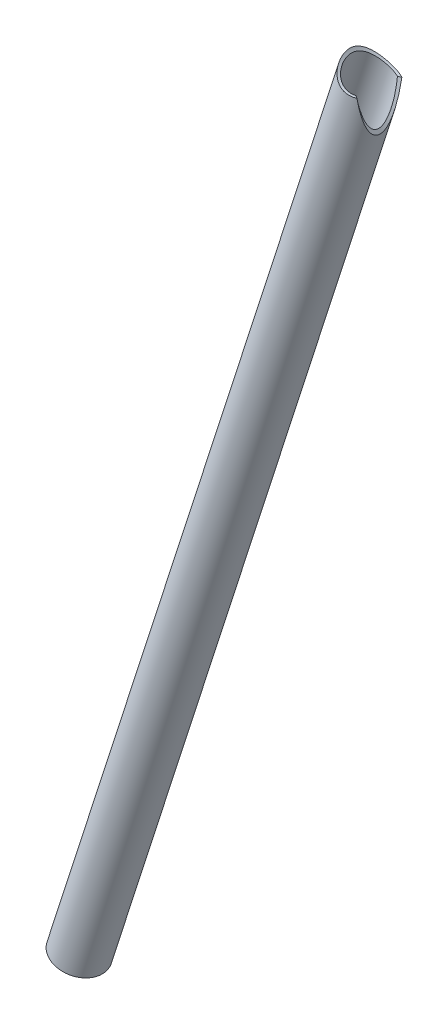
ISO-10303-21;
HEADER;
FILE_DESCRIPTION(('STEP AP214'),'2;1');
FILE_NAME('part.step','',(''),(''),'','','');
FILE_SCHEMA(('AUTOMOTIVE_DESIGN { 1 0 10303 214 1 1 1 1 }'));
ENDSEC;
DATA;
#1=APPLICATION_CONTEXT('core data for automotive mechanical design processes');
#2=APPLICATION_PROTOCOL_DEFINITION('international standard','automotive_design',2000,#1);
#3=PRODUCT_CONTEXT('',#1,'mechanical');
#4=PRODUCT('Part','Part','',(#3));
#5=PRODUCT_RELATED_PRODUCT_CATEGORY('part','',(#4));
#6=PRODUCT_DEFINITION_FORMATION('','',#4);
#7=PRODUCT_DEFINITION_CONTEXT('part definition',#1,'design');
#8=PRODUCT_DEFINITION('design','',#6,#7);
#9=PRODUCT_DEFINITION_SHAPE('','',#8);
#10=(LENGTH_UNIT() NAMED_UNIT(*) SI_UNIT(.MILLI.,.METRE.));
#11=(NAMED_UNIT(*) PLANE_ANGLE_UNIT() SI_UNIT($,.RADIAN.));
#12=(NAMED_UNIT(*) SI_UNIT($,.STERADIAN.) SOLID_ANGLE_UNIT());
#13=UNCERTAINTY_MEASURE_WITH_UNIT(LENGTH_MEASURE(1.E-05),#10,'distance_accuracy_value','');
#14=(GEOMETRIC_REPRESENTATION_CONTEXT(3) GLOBAL_UNCERTAINTY_ASSIGNED_CONTEXT((#13)) GLOBAL_UNIT_ASSIGNED_CONTEXT((#10,
#11,#12)) REPRESENTATION_CONTEXT('',''));
#15=CARTESIAN_POINT('',(0.,0.,0.));
#16=DIRECTION('',(0.,0.,1.));
#17=DIRECTION('',(1.,0.,0.));
#18=AXIS2_PLACEMENT_3D('',#15,#16,#17);
#19=CARTESIAN_POINT('',(-0.475660045373399,524.183761382044,114.597216694036));
#20=DIRECTION('',(-0.0599256750075872,0.0388990717535077,0.997444622869661));
#21=DIRECTION('',(-0.732310027678345,-0.680747809489739,-0.0174483018275184));
#22=AXIS2_PLACEMENT_3D('',#19,#20,#21);
#23=CYLINDRICAL_SURFACE('',#22,11.1125);
#24=CARTESIAN_POINT('',(5.9130729523752,513.91124542213,99.6143753399968));
#25=CARTESIAN_POINT('',(5.75570565116612,513.81945741269,99.5727871745621));
#26=CARTESIAN_POINT('',(5.59461789148314,513.731311486549,99.5371532134711));
#27=CARTESIAN_POINT('',(5.2661139336885,513.563084254013,99.4781106309356));
#28=CARTESIAN_POINT('',(5.09869760368943,513.483003115815,99.4547022644233));
#29=CARTESIAN_POINT('',(4.75931812721733,513.331984601959,99.4204963347299));
#30=CARTESIAN_POINT('',(4.58737523928025,513.261012813432,99.4096499888891));
#31=CARTESIAN_POINT('',(4.23961455037224,513.1284100334,99.4004992234678));
#32=CARTESIAN_POINT('',(4.06379702825878,513.066778372185,99.4021939042293));
#33=CARTESIAN_POINT('',(3.7094936648328,512.953169170453,99.4180501875683));
#34=CARTESIAN_POINT('',(3.53100605324812,512.901198372193,99.4322204575124));
#35=CARTESIAN_POINT('',(3.1728253998558,512.80709829969,99.4727860372781));
#36=CARTESIAN_POINT('',(2.99313226721425,512.76496977581,99.4991822787368));
#37=CARTESIAN_POINT('',(2.6337941113973,512.690473007012,99.5638124781305));
#38=CARTESIAN_POINT('',(2.45414912898686,512.658108289923,99.6020507046886));
#39=CARTESIAN_POINT('',(2.09618473571725,512.602896321692,99.6898543898448));
#40=CARTESIAN_POINT('',(1.91786534060131,512.580049183408,99.7394199827503));
#41=CARTESIAN_POINT('',(1.55942235433526,512.543018351689,99.8506194402023));
#42=CARTESIAN_POINT('',(1.3793565811676,512.52905342561,99.9125120909829));
#43=CARTESIAN_POINT('',(1.02274088782092,512.510068487773,100.046950269955));
#44=CARTESIAN_POINT('',(0.846192150745743,512.505051437396,100.119499316384));
#45=CARTESIAN_POINT('',(0.323277111994263,512.5024243111,100.352162833503));
#46=CARTESIAN_POINT('',(-0.0165647268524844,512.517218574327,100.527358547598));
#47=CARTESIAN_POINT('',(-0.726292416636864,512.578363792574,100.945007321336));
#48=CARTESIAN_POINT('',(-1.09204632214175,512.62946537375,101.193768535987));
#49=CARTESIAN_POINT('',(-1.61156470675109,512.725234864702,101.599749724742));
#50=CARTESIAN_POINT('',(-1.7801125256323,512.760410308454,101.740782497087));
#51=CARTESIAN_POINT('',(-2.10649689790694,512.835658250949,102.033505346257));
#52=CARTESIAN_POINT('',(-2.26433641620159,512.875729385502,102.185192449254));
#53=CARTESIAN_POINT('',(-2.59321150356313,512.96603084146,102.524752787528));
#54=CARTESIAN_POINT('',(-2.76217392444923,513.016850130181,102.714483564573));
#55=CARTESIAN_POINT('',(-3.08237229591199,513.120246603979,103.108065513686));
#56=CARTESIAN_POINT('',(-3.23360261383858,513.172824340851,103.31192114001));
#57=CARTESIAN_POINT('',(-3.51545326221232,513.276461183958,103.732982212855));
#58=CARTESIAN_POINT('',(-3.64613012717742,513.327524130905,103.950148672705));
#59=CARTESIAN_POINT('',(-3.88431320492516,513.424782963256,104.39781878404));
#60=CARTESIAN_POINT('',(-3.99183791010801,513.470982717863,104.628311603235));
#61=CARTESIAN_POINT('',(-4.14582743317662,513.539505235199,105.014755246104));
#62=CARTESIAN_POINT('',(-4.20023732413038,513.56437865596,105.167116460131));
#63=CARTESIAN_POINT('',(-4.29750972504381,513.609811756825,105.476090770791));
#64=CARTESIAN_POINT('',(-4.34037597905646,513.630372835112,105.63270247064));
#65=CARTESIAN_POINT('',(-4.41373345284299,513.666391236589,105.949138610716));
#66=CARTESIAN_POINT('',(-4.44424298392009,513.681856105416,106.108957925977));
#67=CARTESIAN_POINT('',(-4.49240114548017,513.707177074934,106.430976358802));
#68=CARTESIAN_POINT('',(-4.51004949702411,513.717033053976,106.593175527903));
#69=CARTESIAN_POINT('',(-4.53222370089652,513.730898788571,106.919046450562));
#70=CARTESIAN_POINT('',(-4.53672307626078,513.734896740261,107.082720510544));
#71=CARTESIAN_POINT('',(-4.5325889970769,513.737096714385,107.409930346891));
#72=CARTESIAN_POINT('',(-4.52395567725184,513.735298796277,107.573466124659));
#73=CARTESIAN_POINT('',(-4.49393098049643,513.726310378,107.89939044844));
#74=CARTESIAN_POINT('',(-4.47252475570666,513.719113599419,108.061777436401));
#75=CARTESIAN_POINT('',(-4.41757474704508,513.69997970347,108.384270342382));
#76=CARTESIAN_POINT('',(-4.38402384350944,513.688039805107,108.544374864992));
#77=CARTESIAN_POINT('',(-4.29471983206868,513.656397085678,108.905267333265));
#78=CARTESIAN_POINT('',(-4.23539297458775,513.635460686061,109.105065439734));
#79=CARTESIAN_POINT('',(-4.09997057811465,513.589076083644,109.498371984321));
#80=CARTESIAN_POINT('',(-4.02386827660903,513.563626062125,109.69187784971));
#81=CARTESIAN_POINT('',(-3.85645838220008,513.510059692569,110.072035633533));
#82=CARTESIAN_POINT('',(-3.76513411445261,513.481940435233,110.258679758583));
#83=CARTESIAN_POINT('',(-3.56878076596856,513.424810951531,110.624424066729));
#84=CARTESIAN_POINT('',(-3.4637524853821,513.395800777259,110.803524689469));
#85=CARTESIAN_POINT('',(-3.23830233822173,513.337737686697,111.158411078941));
#86=CARTESIAN_POINT('',(-3.11755238265823,513.308703101584,111.333991039212));
#87=CARTESIAN_POINT('',(-2.86391089337281,513.252917481815,111.676616090019));
#88=CARTESIAN_POINT('',(-2.73101511979191,513.226167250932,111.843658168181));
#89=CARTESIAN_POINT('',(-2.45395527123531,513.176373226213,112.168824207186));
#90=CARTESIAN_POINT('',(-2.3097867697621,513.15333089934,112.326944622347));
#91=CARTESIAN_POINT('',(-2.01101844368042,513.11228279978,112.633701876649));
#92=CARTESIAN_POINT('',(-1.85641834919074,513.094277157463,112.782338470236));
#93=CARTESIAN_POINT('',(-1.50335276509599,513.061355302113,113.100280581171));
#94=CARTESIAN_POINT('',(-1.30258248248774,513.047925943267,113.267197790915));
#95=CARTESIAN_POINT('',(-0.88806509775176,513.032398922576,113.584783665214));
#96=CARTESIAN_POINT('',(-0.674315293816763,513.030303628255,113.735448928529));
#97=CARTESIAN_POINT('',(-0.235783523246276,513.039363177531,114.018579235055));
#98=CARTESIAN_POINT('',(-0.0110196313970217,513.050496966321,114.15107282553));
#99=CARTESIAN_POINT('',(0.447885549556993,513.087682424298,114.396173830336));
#100=CARTESIAN_POINT('',(0.682022496806226,513.113727258978,114.508790324454));
#101=CARTESIAN_POINT('',(1.09224583190681,513.172717489412,114.684312525011));
#102=CARTESIAN_POINT('',(1.26669053083149,513.201825996613,114.752389392396));
#103=CARTESIAN_POINT('',(1.61819096089341,513.268978610741,114.876250893515));
#104=CARTESIAN_POINT('',(1.79524610273848,513.307020729051,114.93203825754));
#105=CARTESIAN_POINT('',(2.15065368537754,513.392214849251,115.03061358145));
#106=CARTESIAN_POINT('',(2.32900519310494,513.439360823698,115.073410094312));
#107=CARTESIAN_POINT('',(2.68572263730351,513.542758955722,115.145479515804));
#108=CARTESIAN_POINT('',(2.86408852852994,513.599006870186,115.174758701512));
#109=CARTESIAN_POINT('',(3.20822402177937,513.716548889002,115.21801509928));
#110=CARTESIAN_POINT('',(3.37407391639886,513.777295323432,115.232846335335));
#111=CARTESIAN_POINT('',(3.70350633186681,513.906250659939,115.25018670187));
#112=CARTESIAN_POINT('',(3.86708884607149,513.974459583876,115.252695796251));
#113=CARTESIAN_POINT('',(4.1914491783138,514.118093894455,115.24538712746));
#114=CARTESIAN_POINT('',(4.35221522022983,514.193543627699,115.235526327756));
#115=CARTESIAN_POINT('',(4.66937686170016,514.350797987806,115.203622794231));
#116=CARTESIAN_POINT('',(4.82577239310461,514.432602713689,115.181579870564));
#117=CARTESIAN_POINT('',(4.97949145869509,514.517253673282,115.153555178421));
#118=B_SPLINE_CURVE_WITH_KNOTS('',3,(#24,#25,#26,#27,#28,#29,#30,#31,#32,#33,#34,#35,#36,#37,
#38,#39,#40,#41,#42,#43,#44,#45,#46,#47,#48,#49,#50,#51,#52,#53,#54,#55,#56,#57,#58,#59,#60,#61,
#62,#63,#64,#65,#66,#67,#68,#69,#70,#71,#72,#73,#74,#75,#76,#77,#78,#79,#80,#81,#82,#83,#84,#85,
#86,#87,#88,#89,#90,#91,#92,#93,#94,#95,#96,#97,#98,#99,#100,#101,#102,#103,#104,#105,#106,#107,
#108,#109,#110,#111,#112,#113,#114,#115,#116,#117),.UNSPECIFIED.,.F.,.F.,(4,2,2,2,2,2,2,2,2,2,2,
2,2,2,2,2,2,2,2,2,2,2,2,2,2,2,2,2,2,2,2,2,2,2,2,2,2,2,2,2,2,2,2,2,2,2,4),(0.,0.560463353954686,
1.12093839441187,1.67922954084714,2.23748063743734,2.79611988311252,3.35480170492397,
3.91368514693435,4.47257521591132,5.04474599409809,5.6171061023101,6.76118008767089,
8.09173617145039,8.75898633544301,9.42605099160713,10.2023766392781,10.9789482245999,
11.7533449301444,12.5271207857498,13.0177268561292,13.5081736115972,13.9978908960696,
14.4876188014343,14.9783321526583,15.4690404698842,15.9603203251662,16.45188865471,
17.079359751845,17.7070842590866,18.3355009792519,18.9638810238171,19.6085265882527,
20.2533980512338,20.8985240220205,21.5436666896027,22.3269373986349,23.1103717153677,
23.8925608219497,24.6743916973304,25.2423410760549,25.8101641491172,26.3776125612884,
26.9447972002078,27.4759455536384,28.007095463087,28.5400984505142,29.0731097444833),.UNSPECIFIED.);
#119=CARTESIAN_POINT('',(0.845729685967483,512.506421026561,100.121684494328));
#120=VERTEX_POINT('',#119);
#121=CARTESIAN_POINT('',(-0.149670311386206,512.530385853584,100.608563602288));
#122=VERTEX_POINT('',#121);
#123=EDGE_CURVE('E70',#120,#122,#118,.T.);
#124=ORIENTED_EDGE('',*,*,#123,.F.);
#125=CARTESIAN_POINT('',(5.29417473859454,514.09064985966,106.832821409542));
#126=CARTESIAN_POINT('',(5.29887131290029,514.105921051289,107.011335789787));
#127=CARTESIAN_POINT('',(5.2960084272661,514.117199943479,107.190451095485));
#128=CARTESIAN_POINT('',(5.27500203406285,514.131416171019,107.548199036743));
#129=CARTESIAN_POINT('',(5.25684911818113,514.134348365585,107.726831307171));
#130=CARTESIAN_POINT('',(5.2055261655022,514.132052735206,108.082246870067));
#131=CARTESIAN_POINT('',(5.17232475039703,514.12680780373,108.259025505407));
#132=CARTESIAN_POINT('',(5.09163137495636,514.108808332124,108.608852001149));
#133=CARTESIAN_POINT('',(5.04414069851382,514.096054466573,108.781900195237));
#134=CARTESIAN_POINT('',(4.93640636392974,514.064238616779,109.121406731347));
#135=CARTESIAN_POINT('',(4.87629738848587,514.045242140149,109.287914210304));
#136=CARTESIAN_POINT('',(4.74408835638654,514.002096941516,109.615439623003));
#137=CARTESIAN_POINT('',(4.67198248789722,513.977945720712,109.776454850271));
#138=CARTESIAN_POINT('',(4.43918147454897,513.899634063985,110.25053296402));
#139=CARTESIAN_POINT('',(4.26198728189582,513.839610490097,110.554676082869));
#140=CARTESIAN_POINT('',(3.92658080229634,513.731434817345,111.053865458538));
#141=CARTESIAN_POINT('',(3.77724259060224,513.684745179177,111.255385158984));
#142=CARTESIAN_POINT('',(3.46160096430522,513.591230657946,111.644810376277));
#143=CARTESIAN_POINT('',(3.29529162311677,513.544405733223,111.832711097716));
#144=CARTESIAN_POINT('',(2.94709305321059,513.453265738846,112.194641922495));
#145=CARTESIAN_POINT('',(2.76518129691463,513.408954457148,112.368651244786));
#146=CARTESIAN_POINT('',(2.3872916911531,513.325331420242,112.701944494131));
#147=CARTESIAN_POINT('',(2.19131553047147,513.286019066353,112.861230183889));
#148=CARTESIAN_POINT('',(1.78461776421792,513.214283180333,113.165672061542));
#149=CARTESIAN_POINT('',(1.57377833077769,513.181925505638,113.310686673762));
#150=CARTESIAN_POINT('',(1.14018342509742,513.126688737969,113.583832128033));
#151=CARTESIAN_POINT('',(0.917426726794884,513.103810622389,113.711961228169));
#152=CARTESIAN_POINT('',(0.461940878889936,513.069581378099,113.949688050759));
#153=CARTESIAN_POINT('',(0.229233373683126,513.058206437313,114.05932366168));
#154=CARTESIAN_POINT('',(-0.24476831500328,513.048747988078,114.258774610303));
#155=CARTESIAN_POINT('',(-0.48605920835233,513.050659440242,114.34859744944));
#156=CARTESIAN_POINT('',(-0.912356829309223,513.066954563285,114.486508492756));
#157=CARTESIAN_POINT('',(-1.09595270879993,513.078018806789,114.539393731244));
#158=CARTESIAN_POINT('',(-1.46556498877955,513.108895481694,114.632621548335));
#159=CARTESIAN_POINT('',(-1.6515808599116,513.128706030118,114.67296682346));
#160=CARTESIAN_POINT('',(-2.02471387362773,513.177445340467,114.740506561878));
#161=CARTESIAN_POINT('',(-2.21183041012501,513.206369474883,114.767707681519));
#162=CARTESIAN_POINT('',(-2.58589105968332,513.273537949801,114.808514380689));
#163=CARTESIAN_POINT('',(-2.77283516774436,513.311782552542,114.822119577632));
#164=CARTESIAN_POINT('',(-3.14567401999034,513.397715527463,114.83544598625));
#165=CARTESIAN_POINT('',(-3.33156354799764,513.44543349781,114.835122979537));
#166=CARTESIAN_POINT('',(-3.70019224549397,513.549995542304,114.820381713559));
#167=CARTESIAN_POINT('',(-3.88293142190937,513.606839596383,114.805963485287));
#168=CARTESIAN_POINT('',(-4.24382934449132,513.729195004887,114.763154700622));
#169=CARTESIAN_POINT('',(-4.42198765344713,513.794707182981,114.734762815715));
#170=CARTESIAN_POINT('',(-4.77238139714384,513.933730313336,114.664349406136));
#171=CARTESIAN_POINT('',(-4.94461693838751,514.007241121666,114.622328126689));
#172=CARTESIAN_POINT('',(-5.27401020834472,514.157772859776,114.527496957816));
#173=CARTESIAN_POINT('',(-5.43149556763064,514.234461535643,114.475293865083));
#174=CARTESIAN_POINT('',(-5.73931132330597,514.393564957316,114.359566398535));
#175=CARTESIAN_POINT('',(-5.88963921846976,514.475981680436,114.296038103312));
#176=CARTESIAN_POINT('',(-6.18242998280031,514.645634287735,114.158338671381));
#177=CARTESIAN_POINT('',(-6.32489490343046,514.732868902921,114.084170329029));
#178=CARTESIAN_POINT('',(-6.60159487677913,514.911294802801,113.92585652502));
#179=CARTESIAN_POINT('',(-6.73582689425555,515.00248752583,113.841707416878));
#180=CARTESIAN_POINT('',(-7.14930546757193,515.297512610164,113.559165335699));
#181=CARTESIAN_POINT('',(-7.41263452584189,515.507205365528,113.343197662276));
#182=CARTESIAN_POINT('',(-7.8977076952688,515.932093525035,112.873362088983));
#183=CARTESIAN_POINT('',(-8.11941905367229,516.147293112926,112.619464618548));
#184=CARTESIAN_POINT('',(-8.43961729924997,516.486696530918,112.18949241682));
#185=CARTESIAN_POINT('',(-8.55141111298729,516.612113288493,112.024068860757));
#186=CARTESIAN_POINT('',(-8.76111661987963,516.85983600782,111.682348261175));
#187=CARTESIAN_POINT('',(-8.85902595980808,516.982141439369,111.506049381688));
#188=CARTESIAN_POINT('',(-9.04125624511243,517.221601020644,111.143072488937));
#189=CARTESIAN_POINT('',(-9.12556959691503,517.3387522653,110.956388753311));
#190=CARTESIAN_POINT('',(-9.28077982830921,517.56551493786,110.57314009754));
#191=CARTESIAN_POINT('',(-9.35167910056684,517.675127708175,110.376576947517));
#192=CARTESIAN_POINT('',(-9.47013599994479,517.867765132284,110.00550266978));
#193=CARTESIAN_POINT('',(-9.51961047119747,517.952263691152,109.83236727453));
#194=CARTESIAN_POINT('',(-9.60916024475464,518.11219473564,109.479565758128));
#195=CARTESIAN_POINT('',(-9.64923564341324,518.187627314196,109.299899703947));
#196=CARTESIAN_POINT('',(-9.71988054373792,518.327263998026,108.93476708474));
#197=CARTESIAN_POINT('',(-9.75046598452656,518.391486850646,108.749310827936));
#198=CARTESIAN_POINT('',(-9.80210997896525,518.506650933044,108.373039207796));
#199=CARTESIAN_POINT('',(-9.82317194918639,518.557596923149,108.182225792489));
#200=CARTESIAN_POINT('',(-9.85263936755054,518.636044954417,107.832046897656));
#201=CARTESIAN_POINT('',(-9.86266586678876,518.666140915389,107.673397687762));
#202=CARTESIAN_POINT('',(-9.87624339258512,518.715024369319,107.354158395346));
#203=CARTESIAN_POINT('',(-9.87979805497872,518.733818207758,107.193569453633));
#204=CARTESIAN_POINT('',(-9.88040518230365,518.759314272853,106.871526586472));
#205=CARTESIAN_POINT('',(-9.87746231045743,518.766025165056,106.710073364277));
#206=CARTESIAN_POINT('',(-9.86509728740428,518.766961377914,106.387370849301));
#207=CARTESIAN_POINT('',(-9.85567503703367,518.761186507477,106.226121559677));
#208=CARTESIAN_POINT('',(-9.83042299777208,518.73717988116,105.905066740607));
#209=CARTESIAN_POINT('',(-9.81459336329012,518.718948425458,105.745261176462));
#210=CARTESIAN_POINT('',(-9.77665035908226,518.670507674773,105.42824673982));
#211=CARTESIAN_POINT('',(-9.75453701103305,518.640298421109,105.271037858367));
#212=CARTESIAN_POINT('',(-9.70415302905823,518.568709675905,104.960020697085));
#213=CARTESIAN_POINT('',(-9.67587564243958,518.527317921958,104.806216352089));
#214=CARTESIAN_POINT('',(-9.61332379841815,518.434453922741,104.502861686994));
#215=CARTESIAN_POINT('',(-9.57904588343316,518.38297586356,104.353313877642));
#216=CARTESIAN_POINT('',(-9.49198219193278,518.252133580618,104.009009375319));
#217=CARTESIAN_POINT('',(-9.43686695454433,518.169239940357,103.816177443208));
#218=CARTESIAN_POINT('',(-9.31637406168443,517.990458820689,103.439956289281));
#219=CARTESIAN_POINT('',(-9.25099206393359,517.89456584563,103.256571106707));
#220=CARTESIAN_POINT('',(-9.1100125416277,517.692397182024,102.89942418096));
#221=CARTESIAN_POINT('',(-9.03440253936,517.58610885618,102.725674563615));
#222=CARTESIAN_POINT('',(-8.87304020945962,517.365662692273,102.388222327174));
#223=CARTESIAN_POINT('',(-8.78728865468528,517.251505454153,102.224518943926));
#224=CARTESIAN_POINT('',(-8.60312143595886,517.014283480522,101.903030526074));
#225=CARTESIAN_POINT('',(-8.50442906030965,516.891062396847,101.745519690999));
#226=CARTESIAN_POINT('',(-8.29604826978162,516.640472127148,101.441339137857));
#227=CARTESIAN_POINT('',(-8.18635587941556,516.51310145274,101.29467337279));
#228=CARTESIAN_POINT('',(-7.95577703833052,516.256019242679,101.012527514295));
#229=CARTESIAN_POINT('',(-7.83488790647037,516.126307152374,100.87705011477));
#230=CARTESIAN_POINT('',(-7.58176122441265,515.866261249123,100.617800296247));
#231=CARTESIAN_POINT('',(-7.44952378122089,515.735927442051,100.494027766903));
#232=CARTESIAN_POINT('',(-7.15000041590969,515.45408891831,100.23873164473));
#233=CARTESIAN_POINT('',(-6.98058406560342,515.302766087752,100.109488575313));
#234=CARTESIAN_POINT('',(-6.62597562760783,515.004081973337,99.8691743528612));
#235=CARTESIAN_POINT('',(-6.44078060796419,514.856721432465,99.7581065883648));
#236=CARTESIAN_POINT('',(-6.05531510652386,514.568902253836,99.5558649502606));
#237=CARTESIAN_POINT('',(-5.8550696934329,514.428432756,99.46465894015));
#238=CARTESIAN_POINT('',(-5.4401583580499,514.156922405693,99.3036014500056));
#239=CARTESIAN_POINT('',(-5.2254993611245,514.025877086941,99.2337398028342));
#240=CARTESIAN_POINT('',(-4.8460933578888,513.81141077216,99.1335251329118));
#241=CARTESIAN_POINT('',(-4.68447054071166,513.725028722666,99.0975863901821));
#242=CARTESIAN_POINT('',(-4.35541011894974,513.559432263806,99.0379706930212));
#243=CARTESIAN_POINT('',(-4.18797378305293,513.480216304017,99.0142910809967));
#244=CARTESIAN_POINT('',(-3.84835407426972,513.329864678773,98.9796030099161));
#245=CARTESIAN_POINT('',(-3.6761737984483,513.25872388985,98.9685864755351));
#246=CARTESIAN_POINT('',(-3.32809804030309,513.125205047679,98.9594452326085));
#247=CARTESIAN_POINT('',(-3.15220241586094,513.062827330335,98.9613210181096));
#248=CARTESIAN_POINT('',(-2.79771832373903,512.947332539766,98.9780462045391));
#249=CARTESIAN_POINT('',(-2.61912630641131,512.894229089878,98.9929145015167));
#250=CARTESIAN_POINT('',(-2.26085229129381,512.797772607284,99.0355226742466));
#251=CARTESIAN_POINT('',(-2.08117029881944,512.754419527068,99.0632624872787));
#252=CARTESIAN_POINT('',(-1.72202356844962,512.677612141887,99.13130829879));
#253=CARTESIAN_POINT('',(-1.54255890482574,512.644160591764,99.1716177880603));
#254=CARTESIAN_POINT('',(-1.18520311439581,512.587113549247,99.2643228016002));
#255=CARTESIAN_POINT('',(-1.00731200023811,512.563518136008,99.316718422928));
#256=CARTESIAN_POINT('',(-0.656513722821927,512.526163780377,99.4322733267595));
#257=CARTESIAN_POINT('',(-0.483572037066276,512.51228524472,99.49528945331));
#258=CARTESIAN_POINT('',(-0.141389802550177,512.493470221988,99.6318846513221));
#259=CARTESIAN_POINT('',(0.0278494193795713,512.488536890328,99.7054674402922));
#260=CARTESIAN_POINT('',(0.528520123536239,512.486395455214,99.9410204594246));
#261=CARTESIAN_POINT('',(0.853162559938359,512.501820148115,100.117881300442));
#262=CARTESIAN_POINT('',(1.5167569930341,512.564743374381,100.529805851926));
#263=CARTESIAN_POINT('',(1.85252355623152,512.615968253369,100.76936034142));
#264=CARTESIAN_POINT('',(2.48846160250641,512.745652594114,101.28607310855));
#265=CARTESIAN_POINT('',(2.78859104925321,512.824143798379,101.56327498388));
#266=CARTESIAN_POINT('',(3.23393225244605,512.96316578246,102.031049821222));
#267=CARTESIAN_POINT('',(3.39243755365198,513.017982996921,102.210897553181));
#268=CARTESIAN_POINT('',(3.69419677278531,513.131702313713,102.581890297626));
#269=CARTESIAN_POINT('',(3.83744715229738,513.190605358554,102.773037915227));
#270=CARTESIAN_POINT('',(4.10737628796845,513.310147449138,103.16622352911));
#271=CARTESIAN_POINT('',(4.2340529849295,513.370786709458,103.368262874239));
#272=CARTESIAN_POINT('',(4.46921266126621,513.491164662842,103.782892036069));
#273=CARTESIAN_POINT('',(4.57770268950415,513.55090369661,103.99547772358));
#274=CARTESIAN_POINT('',(4.74983886572524,513.652024165861,104.37618563049));
#275=CARTESIAN_POINT('',(4.81790805335698,513.694252411157,104.54208937384));
#276=CARTESIAN_POINT('',(4.94176265005566,513.77518749421,104.879308213841));
#277=CARTESIAN_POINT('',(4.99754737885171,513.813894136883,105.050623609569));
#278=CARTESIAN_POINT('',(5.09556947274385,513.886220218301,105.397450920162));
#279=CARTESIAN_POINT('',(5.13785580803315,513.919857806745,105.57294512524));
#280=CARTESIAN_POINT('',(5.20807473249483,513.980809267508,105.927794465511));
#281=CARTESIAN_POINT('',(5.23601741211236,514.008127577846,106.107146793802));
#282=CARTESIAN_POINT('',(5.26650204858832,514.043462157306,106.378074714823));
#283=CARTESIAN_POINT('',(5.27475792487079,514.054297440297,106.468672855446));
#284=CARTESIAN_POINT('',(5.28739443443329,514.073987141824,106.650401913972));
#285=CARTESIAN_POINT('',(5.29177301396974,514.082840508717,106.741533088523));
#286=CARTESIAN_POINT('',(5.29417473859454,514.09064985966,106.832821409542));
#287=B_SPLINE_CURVE_WITH_KNOTS('',3,(#125,#126,#127,#128,#129,#130,#131,#132,#133,#134,#135,
#136,#137,#138,#139,#140,#141,#142,#143,#144,#145,#146,#147,#148,#149,#150,#151,#152,#153,#154,
#155,#156,#157,#158,#159,#160,#161,#162,#163,#164,#165,#166,#167,#168,#169,#170,#171,#172,#173,
#174,#175,#176,#177,#178,#179,#180,#181,#182,#183,#184,#185,#186,#187,#188,#189,#190,#191,#192,
#193,#194,#195,#196,#197,#198,#199,#200,#201,#202,#203,#204,#205,#206,#207,#208,#209,#210,#211,
#212,#213,#214,#215,#216,#217,#218,#219,#220,#221,#222,#223,#224,#225,#226,#227,#228,#229,#230,
#231,#232,#233,#234,#235,#236,#237,#238,#239,#240,#241,#242,#243,#244,#245,#246,#247,#248,#249,
#250,#251,#252,#253,#254,#255,#256,#257,#258,#259,#260,#261,#262,#263,#264,#265,#266,#267,#268,
#269,#270,#271,#272,#273,#274,#275,#276,#277,#278,#279,#280,#281,#282,#283,#284,#285,#286),
.UNSPECIFIED.,.T.,.F.,(4,2,2,2,2,2,2,2,2,2,2,2,2,2,2,2,2,2,2,2,2,2,2,2,2,2,2,2,2,2,2,2,2,2,2,2,
2,2,2,2,2,2,2,2,2,2,2,2,2,2,2,2,2,2,2,2,2,2,2,2,2,2,2,2,2,2,2,2,2,2,2,2,2,2,2,2,2,2,2,2,4),(0.,
0.537573187970764,1.07547739912958,1.61450841568219,2.15349101464677,2.68698929400761,
3.22074678047323,4.28811161681994,5.05269587078132,5.8175480493138,6.58352377605878,
7.34940768162977,8.1222524385707,8.895176860186,9.66649799899464,10.4375265999706,
11.0110990553793,11.5845480875812,12.157706413587,12.7308808676992,13.3058751337591,
13.8808681354744,14.4559158139332,15.0309531465155,15.5786946013315,16.1266260840399,
16.6744139280755,17.2224025271075,18.4174321262966,19.6133982957202,20.320136467705,
21.0269942792552,21.7342455247785,22.4413704988943,23.0376050471546,23.6338334828804,
24.229055016895,24.8240628438032,25.3089403183394,25.7935453077403,26.2778026135183,
26.7620673307795,27.246320378632,27.730571755996,28.2153563200581,28.7004211483076,
29.350477162006,30.0008088581575,30.6519412081266,31.3030239691203,31.9714674083209,
32.6401533046179,33.3089997386435,33.9778398666553,34.7607944898401,35.543894918398,
36.3257187105696,37.1071695074008,37.6668439956602,38.2263971041284,38.7855931837126,
39.3448106923689,39.9048428719865,40.4648723227185,41.0250574409016,41.5852470578267,
42.1384146638492,42.691777361409,43.7976920179299,45.0402062134829,46.284171775466,
47.0212623806408,47.7585235850366,48.4958763036731,49.2329425720825,49.7851746974353,
50.3374373958088,50.8876731754326,51.4375213440299,51.7122789805901,51.9871820650792),.UNSPECIFIED.);
#288=CARTESIAN_POINT('',(0.00263960369829752,513.053689315165,114.154662329749));
#289=VERTEX_POINT('',#288);
#290=EDGE_CURVE('E82',#289,#120,#287,.T.);
#291=ORIENTED_EDGE('',*,*,#290,.F.);
#292=CARTESIAN_POINT('',(-0.92729552789105,513.035159460061,113.551898670475));
#293=VERTEX_POINT('',#292);
#294=EDGE_CURVE('E53',#293,#289,#118,.T.);
#295=ORIENTED_EDGE('',*,*,#294,.F.);
#296=CARTESIAN_POINT('',(4.20677357722796,513.579522905785,106.848668984383));
#297=CARTESIAN_POINT('',(4.21051371124519,513.591679203165,107.016371139129));
#298=CARTESIAN_POINT('',(4.20708406281389,513.600968810017,107.184447618743));
#299=CARTESIAN_POINT('',(4.18580608970749,513.613596211461,107.519973788917));
#300=CARTESIAN_POINT('',(4.16795220248857,513.616931708325,107.687423212629));
#301=CARTESIAN_POINT('',(4.11806229024851,513.617780238996,108.020403786548));
#302=CARTESIAN_POINT('',(4.08600951855789,513.615286382557,108.185932434047));
#303=CARTESIAN_POINT('',(4.00828113895968,513.604927123863,108.513649541598));
#304=CARTESIAN_POINT('',(3.96259924883412,513.597059242339,108.675836424359));
#305=CARTESIAN_POINT('',(3.85880069402672,513.576752256795,108.994521692134));
#306=CARTESIAN_POINT('',(3.8007797340955,513.564347834599,109.15105358667));
#307=CARTESIAN_POINT('',(3.67297578961154,513.535832973094,109.458917879717));
#308=CARTESIAN_POINT('',(3.60318809263375,513.519721048033,109.610248165703));
#309=CARTESIAN_POINT('',(3.3775629422216,513.467259334358,110.055393784644));
#310=CARTESIAN_POINT('',(3.20539874386667,513.426769122965,110.340557534084));
#311=CARTESIAN_POINT('',(2.803749563348,513.337973044409,110.913544164866));
#312=CARTESIAN_POINT('',(2.57009586027402,513.289294749115,111.198368114266));
#313=CARTESIAN_POINT('',(2.19112617934981,513.220412226609,111.599118749584));
#314=CARTESIAN_POINT('',(2.05995174379789,513.198126223675,111.728370215814));
#315=CARTESIAN_POINT('',(1.78873134659657,513.155990411976,111.977737008619));
#316=CARTESIAN_POINT('',(1.6486836570695,513.136141079926,112.097850545693));
#317=CARTESIAN_POINT('',(1.33352743856261,513.096535623683,112.350019519856));
#318=CARTESIAN_POINT('',(1.15675611504495,513.07748941303,112.480114981689));
#319=CARTESIAN_POINT('',(0.792984615178949,513.045915044751,112.72589620435));
#320=CARTESIAN_POINT('',(0.605987827048157,513.033384742363,112.841586697138));
#321=CARTESIAN_POINT('',(0.22305323995097,513.016340743644,113.057565327424));
#322=CARTESIAN_POINT('',(0.0271199836481819,513.011823019865,113.157861179725));
#323=CARTESIAN_POINT('',(-0.372315855375324,513.012170707288,113.341981422515));
#324=CARTESIAN_POINT('',(-0.575816362737576,513.017033564162,113.425810290112));
#325=CARTESIAN_POINT('',(-0.94837799016394,513.035348511538,113.561178625516));
#326=CARTESIAN_POINT('',(-1.11640688620702,513.046938506564,113.615826841623));
#327=CARTESIAN_POINT('',(-1.4552434862566,513.077472020918,113.71309327753));
#328=CARTESIAN_POINT('',(-1.62605064729299,513.096414119545,113.755713818777));
#329=CARTESIAN_POINT('',(-1.96920331785149,513.142018056488,113.828354517295));
#330=CARTESIAN_POINT('',(-2.14154780076221,513.168675069543,113.858382521853));
#331=CARTESIAN_POINT('',(-2.48661632060124,513.229930616572,113.905419925556));
#332=CARTESIAN_POINT('',(-2.6593403644356,513.264529296248,113.922429085825));
#333=CARTESIAN_POINT('',(-3.00438666155996,513.341825997655,113.943146120567));
#334=CARTESIAN_POINT('',(-3.17670564766192,513.384550676959,113.94680939308));
#335=CARTESIAN_POINT('',(-3.51896050921355,513.477847790355,113.94057243926));
#336=CARTESIAN_POINT('',(-3.68889638406025,513.528420226432,113.930672209495));
#337=CARTESIAN_POINT('',(-4.02502705890745,513.637034286329,113.897370482163));
#338=CARTESIAN_POINT('',(-4.19122161137951,513.695076402653,113.873968093996));
#339=CARTESIAN_POINT('',(-4.5185833585688,513.818056401146,113.813924624456));
#340=CARTESIAN_POINT('',(-4.67975067968479,513.88299410976,113.777283876226));
#341=CARTESIAN_POINT('',(-4.98763532428761,514.015463580779,113.693467766208));
#342=CARTESIAN_POINT('',(-5.13466714076763,514.082680497116,113.646945964025));
#343=CARTESIAN_POINT('',(-5.42246440027812,514.221956200115,113.542889724051));
#344=CARTESIAN_POINT('',(-5.56322767375596,514.294016641807,113.485351509418));
#345=CARTESIAN_POINT('',(-5.83775313796042,514.442152818269,113.35985952096));
#346=CARTESIAN_POINT('',(-5.97151736790676,514.51822737038,113.291908803812));
#347=CARTESIAN_POINT('',(-6.23165771231058,514.673616379346,113.146162859686));
#348=CARTESIAN_POINT('',(-6.35803097176328,514.752932068361,113.068363864731));
#349=CARTESIAN_POINT('',(-6.61205705189892,514.919892941936,112.897457632138));
#350=CARTESIAN_POINT('',(-6.73911556807225,515.007720767264,112.803644274355));
#351=CARTESIAN_POINT('',(-6.9840268766979,515.185074858644,112.606121374112));
#352=CARTESIAN_POINT('',(-7.10187648495687,515.274601698987,112.502408435938));
#353=CARTESIAN_POINT('',(-7.44149590987072,515.544271089133,112.177308001554));
#354=CARTESIAN_POINT('',(-7.64936175386139,515.725519572066,111.941941568538));
#355=CARTESIAN_POINT('',(-7.94704714799105,516.006244469044,111.545936006231));
#356=CARTESIAN_POINT('',(-8.04953758881921,516.107793973799,111.395950278425));
#357=CARTESIAN_POINT('',(-8.24217993407929,516.307247895007,111.085951513899));
#358=CARTESIAN_POINT('',(-8.33233436484268,516.405153054797,110.925940540097));
#359=CARTESIAN_POINT('',(-8.50038420315971,516.595538372489,110.596431503918));
#360=CARTESIAN_POINT('',(-8.57827558585956,516.688016743043,110.426930351413));
#361=CARTESIAN_POINT('',(-8.72177441669417,516.8655175798,110.079133669407));
#362=CARTESIAN_POINT('',(-8.78738239546306,516.950540367994,109.900838520222));
#363=CARTESIAN_POINT('',(-8.94929883852175,517.169066907347,109.403856214477));
#364=CARTESIAN_POINT('',(-9.03355652166937,517.293234167116,109.076777950027));
#365=CARTESIAN_POINT('',(-9.13173087048519,517.448784717114,108.571717883456));
#366=CARTESIAN_POINT('',(-9.15975225018323,517.495515079497,108.400974980232));
#367=CARTESIAN_POINT('',(-9.20628174542371,517.577268036486,108.055454995836));
#368=CARTESIAN_POINT('',(-9.22479453206611,517.612296376754,107.88067993964));
#369=CARTESIAN_POINT('',(-9.252289439135,517.669540118316,107.526573739068));
#370=CARTESIAN_POINT('',(-9.2611793290395,517.691630610267,107.347215083003));
#371=CARTESIAN_POINT('',(-9.26901216989444,517.721397740278,106.987071707575));
#372=CARTESIAN_POINT('',(-9.26795535014485,517.729074710605,106.806287021184));
#373=CARTESIAN_POINT('',(-9.25588906734845,517.729456702344,106.445128145198));
#374=CARTESIAN_POINT('',(-9.24488501166983,517.722169855426,106.264753785948));
#375=CARTESIAN_POINT('',(-9.21304148554902,517.692720469139,105.906113827987));
#376=CARTESIAN_POINT('',(-9.19220274018428,517.67055902637,105.727848074808));
#377=CARTESIAN_POINT('',(-9.1444752572796,517.616142941597,105.399611988068));
#378=CARTESIAN_POINT('',(-9.11882937129466,517.585718443555,105.249151566731));
#379=CARTESIAN_POINT('',(-9.06058290752341,517.515131483953,104.951885414553));
#380=CARTESIAN_POINT('',(-9.02798034283027,517.474966239878,104.80508074124));
#381=CARTESIAN_POINT('',(-8.91999485120346,517.341203621132,104.37120346689));
#382=CARTESIAN_POINT('',(-8.83443470121589,517.234340049045,104.090671539801));
#383=CARTESIAN_POINT('',(-8.60392972465487,516.952683931396,103.459198130958));
#384=CARTESIAN_POINT('',(-8.4486843189133,516.767151195399,103.116803045898));
#385=CARTESIAN_POINT('',(-8.18247965200184,516.467162537879,102.635830856645));
#386=CARTESIAN_POINT('',(-8.08806636886043,516.363425268868,102.480790972302));
#387=CARTESIAN_POINT('',(-7.88806540643852,516.150669220502,102.181870315144));
#388=CARTESIAN_POINT('',(-7.7824785194772,516.041650815928,102.037988752347));
#389=CARTESIAN_POINT('',(-7.55893575705661,515.819067751667,101.760369191102));
#390=CARTESIAN_POINT('',(-7.44085623545045,515.705466196843,101.626760663181));
#391=CARTESIAN_POINT('',(-7.19325727987075,515.47667137157,101.371969699952));
#392=CARTESIAN_POINT('',(-7.06373461331818,515.361477659153,101.250790796919));
#393=CARTESIAN_POINT('',(-6.7933757124342,515.131358596092,101.021637687725));
#394=CARTESIAN_POINT('',(-6.65254389694354,515.016433158512,100.913658365267));
#395=CARTESIAN_POINT('',(-6.35967260239072,514.788550491798,100.711660025177));
#396=CARTESIAN_POINT('',(-6.20763238951272,514.675593392131,100.617641922804));
#397=CARTESIAN_POINT('',(-5.88849354772815,514.450443598556,100.44219339546));
#398=CARTESIAN_POINT('',(-5.72110153778,514.338351556006,100.361165349208));
#399=CARTESIAN_POINT('',(-5.37562787343093,514.120059867815,100.21592730253));
#400=CARTESIAN_POINT('',(-5.1975518426144,514.013857177962,100.151708548276));
#401=CARTESIAN_POINT('',(-4.83182860688364,513.809247645661,100.041142344788));
#402=CARTESIAN_POINT('',(-4.64418995456843,513.710834031221,99.9947792327945));
#403=CARTESIAN_POINT('',(-4.26067184845774,513.523491176104,99.9207862939023));
#404=CARTESIAN_POINT('',(-4.06479421194975,513.434559859039,99.8931523586498));
#405=CARTESIAN_POINT('',(-3.69637136883635,513.280187469573,99.8599552347105));
#406=CARTESIAN_POINT('',(-3.52470107640038,513.213220953118,99.8517159139075));
#407=CARTESIAN_POINT('',(-3.17810433926835,513.088069978227,99.8494887409014));
#408=CARTESIAN_POINT('',(-3.00317827339844,513.029884505159,99.855499240816));
#409=CARTESIAN_POINT('',(-2.65160512481253,512.922888301347,99.8817631261479));
#410=CARTESIAN_POINT('',(-2.47495863063556,512.874074475376,99.9020117987037));
#411=CARTESIAN_POINT('',(-2.12142281201332,512.78612714555,99.9565181236961));
#412=CARTESIAN_POINT('',(-1.94453349421904,512.746993381675,99.9907753997754));
#413=CARTESIAN_POINT('',(-1.60738154806526,512.681459343664,100.069284995362));
#414=CARTESIAN_POINT('',(-1.44701130419078,512.654247446311,100.112408417572));
#415=CARTESIAN_POINT('',(-1.12837108310632,512.60781462078,100.209527458544));
#416=CARTESIAN_POINT('',(-0.970101768266537,512.588596157401,100.263526423208));
#417=CARTESIAN_POINT('',(-0.656767799077718,512.55789041901,100.381836383288));
#418=CARTESIAN_POINT('',(-0.501702149508967,512.54640070696,100.446144120204));
#419=CARTESIAN_POINT('',(-0.195558772706392,512.530731298308,100.584530192467));
#420=CARTESIAN_POINT('',(-0.0444826189457054,512.526554444736,100.658612315786));
#421=CARTESIAN_POINT('',(0.262696897310343,512.524961923093,100.821159631874));
#422=CARTESIAN_POINT('',(0.418471177384544,512.52801205333,100.910252262711));
#423=CARTESIAN_POINT('',(0.723730617796313,512.541134332862,101.09817117809));
#424=CARTESIAN_POINT('',(0.873213598780709,512.551208894584,101.197000796628));
#425=CARTESIAN_POINT('',(1.31126297553014,512.590836955465,101.507239436718));
#426=CARTESIAN_POINT('',(1.58948802887049,512.629795073143,101.732429223362));
#427=CARTESIAN_POINT('',(2.00139192214158,512.70535752453,102.112071701382));
#428=CARTESIAN_POINT('',(2.1462646746558,512.735930818556,102.255933982657));
#429=CARTESIAN_POINT('',(2.42426442895101,512.801627668227,102.55363865525));
#430=CARTESIAN_POINT('',(2.55739370622493,512.836750339085,102.707479103063));
#431=CARTESIAN_POINT('',(2.81106052423079,512.91008275558,103.024726195277));
#432=CARTESIAN_POINT('',(2.93158864053197,512.948294774404,103.188139858986));
#433=CARTESIAN_POINT('',(3.15887849230699,513.026166076522,103.523873420011));
#434=CARTESIAN_POINT('',(3.26564046259529,513.065825335115,103.696193165341));
#435=CARTESIAN_POINT('',(3.54021851140019,513.175164582773,104.184510726521));
#436=CARTESIAN_POINT('',(3.69239776583392,513.244641755016,104.509736518012));
#437=CARTESIAN_POINT('',(3.87957698020887,513.340488236753,105.013541089922));
#438=CARTESIAN_POINT('',(3.93508586735012,513.37101517943,105.183954194859));
#439=CARTESIAN_POINT('',(4.03152007393125,513.428054267506,105.529497039193));
#440=CARTESIAN_POINT('',(4.07245315442848,513.454568545159,105.704624214934));
#441=CARTESIAN_POINT('',(4.13538344777563,513.499967669913,106.040482592729));
#442=CARTESIAN_POINT('',(4.15888370914408,513.519354330076,106.200865268725));
#443=CARTESIAN_POINT('',(4.19276685501073,513.553235696727,106.523603690046));
#444=CARTESIAN_POINT('',(4.20314480554642,513.567728561658,106.68596015436));
#445=CARTESIAN_POINT('',(4.20677357722796,513.579522905785,106.848668984383));
#446=B_SPLINE_CURVE_WITH_KNOTS('',3,(#296,#297,#298,#299,#300,#301,#302,#303,#304,#305,#306,
#307,#308,#309,#310,#311,#312,#313,#314,#315,#316,#317,#318,#319,#320,#321,#322,#323,#324,#325,
#326,#327,#328,#329,#330,#331,#332,#333,#334,#335,#336,#337,#338,#339,#340,#341,#342,#343,#344,
#345,#346,#347,#348,#349,#350,#351,#352,#353,#354,#355,#356,#357,#358,#359,#360,#361,#362,#363,
#364,#365,#366,#367,#368,#369,#370,#371,#372,#373,#374,#375,#376,#377,#378,#379,#380,#381,#382,
#383,#384,#385,#386,#387,#388,#389,#390,#391,#392,#393,#394,#395,#396,#397,#398,#399,#400,#401,
#402,#403,#404,#405,#406,#407,#408,#409,#410,#411,#412,#413,#414,#415,#416,#417,#418,#419,#420,
#421,#422,#423,#424,#425,#426,#427,#428,#429,#430,#431,#432,#433,#434,#435,#436,#437,#438,#439,
#440,#441,#442,#443,#444,#445),.UNSPECIFIED.,.T.,.F.,(4,2,2,2,2,2,2,2,2,2,2,2,2,2,2,2,2,2,2,2,2,
2,2,2,2,2,2,2,2,2,2,2,2,2,2,2,2,2,2,2,2,2,2,2,2,2,2,2,2,2,2,2,2,2,2,2,2,2,2,2,2,2,2,2,2,2,2,2,2,
2,2,2,2,2,4),(0.,0.504379660084982,1.00895392135387,1.51412488653224,2.01952906636667,
2.52114755583214,3.02296741623106,4.02599973188228,5.13667598510323,5.69280241835898,
6.24903748024989,6.9091679884085,7.56908107172184,8.22866236164458,8.88806407310574,
9.41873878543218,9.94931100265837,10.4795520901988,11.0098029066289,11.5418242041804,
12.0738456363421,12.6059021645661,13.1379453045877,13.6420746291887,14.1463770988366,
14.6505318088195,15.1548799960336,15.6964621915397,16.238230830534,17.3216635544132,
17.9455079292046,18.5692243530572,19.1931450619662,19.8170388117312,20.8915410747599,
21.428686189358,21.9655671782269,22.5075495368599,23.0495194012874,23.5911948251869,
24.1328303194794,24.5992115381791,25.0657261394009,25.9987672929,27.2494773091493,
27.8762130029027,28.5029042846284,29.1365118415138,29.7702989623065,30.4038396363358,
31.0374218252891,31.6878941399943,32.3380270291921,32.9875883234414,33.6370070865077,
34.1896111959969,34.7421514041871,35.2945088065857,35.8468513702375,36.3511389124168,
36.8555818381518,37.3598656278233,37.8643454251431,38.4022150958348,38.9402695802917,
40.0161825413258,40.6350218361854,41.2537409560643,41.8729195557473,42.4920875924654,
43.58409144662,44.1289780406539,44.6735740681295,45.1627519694252,45.6521137459883),.UNSPECIFIED.);
#447=EDGE_CURVE('E78',#293,#122,#446,.T.);
#448=ORIENTED_EDGE('',*,*,#447,.T.);
#449=EDGE_LOOP('',(#124,#291,#295,#448));
#450=FACE_BOUND('',#449,.T.);
#451=ADVANCED_FACE('F43',(#450),#23,.F.);
#452=CARTESIAN_POINT('',(-3.26740108656312,513.25594646867,106.897826739104));
#453=DIRECTION('',(-0.294029344122668,-0.955595368398672,0.0196019562748446));
#454=DIRECTION('',(0.95577900872195,-0.294085848837523,0.));
#455=AXIS2_PLACEMENT_3D('',#452,#453,#454);
#456=CYLINDRICAL_SURFACE('',#455,7.9375);
#457=CARTESIAN_POINT('',(-93.2952787292369,220.66534412998,112.899685248616));
#458=DIRECTION('',(0.294029344122668,0.955595368398672,-0.0196019562748446));
#459=DIRECTION('',(-0.95577900872195,0.294085848837523,0.));
#460=AXIS2_PLACEMENT_3D('',#457,#458,#459);
#461=CIRCLE('',#460,7.9375);
#462=CARTESIAN_POINT('',(-100.881774610967,222.999650555128,112.899685248616));
#463=VERTEX_POINT('',#462);
#464=EDGE_CURVE('E47',#463,#463,#461,.T.);
#465=ORIENTED_EDGE('',*,*,#464,.T.);
#466=EDGE_LOOP('',(#465));
#467=FACE_BOUND('',#466,.T.);
#468=CARTESIAN_POINT('',(0.,523.875,106.68));
#469=DIRECTION('',(-0.997472718226184,-0.0405450658339125,-0.0583461569513515));
#470=DIRECTION('',(0.0381718465541401,-0.9984202320933,0.0412304532767711));
#471=AXIS2_PLACEMENT_3D('',#468,#469,#470);
#472=ELLIPSE('',#471,23.988535495204,7.9375);
#473=EDGE_CURVE('E67',#289,#120,#472,.F.);
#474=ORIENTED_EDGE('',*,*,#473,.F.);
#475=ORIENTED_EDGE('',*,*,#290,.T.);
#476=EDGE_LOOP('',(#474,#475));
#477=FACE_BOUND('',#476,.T.);
#478=ADVANCED_FACE('F103',(#467,#477),#456,.T.);
#479=CARTESIAN_POINT('',(-3.26740108656312,513.25594646867,106.897826739104));
#480=DIRECTION('',(-0.294029344122668,-0.955595368398672,0.0196019562748446));
#481=DIRECTION('',(0.95577900872195,-0.294085848837523,0.));
#482=AXIS2_PLACEMENT_3D('',#479,#480,#481);
#483=CYLINDRICAL_SURFACE('',#482,7.0485);
#484=CARTESIAN_POINT('',(-93.2952787292369,220.66534412998,112.899685248616));
#485=DIRECTION('',(0.294029344122668,0.955595368398672,-0.0196019562748446));
#486=DIRECTION('',(-0.95577900872195,0.294085848837523,0.));
#487=AXIS2_PLACEMENT_3D('',#484,#485,#486);
#488=CIRCLE('',#487,7.0485);
#489=CARTESIAN_POINT('',(-100.032087072214,222.738208235511,112.899685248616));
#490=VERTEX_POINT('',#489);
#491=EDGE_CURVE('E12',#490,#490,#488,.T.);
#492=ORIENTED_EDGE('',*,*,#491,.F.);
#493=EDGE_LOOP('',(#492));
#494=FACE_BOUND('',#493,.T.);
#495=ORIENTED_EDGE('',*,*,#447,.F.);
#496=CARTESIAN_POINT('',(-1.78860453726457,517.520286249385,113.857445353643));
#497=CARTESIAN_POINT('',(-1.73625796668599,517.339806153476,113.858159308655));
#498=CARTESIAN_POINT('',(-1.68721003191021,517.158413851708,113.856778566226));
#499=CARTESIAN_POINT('',(-1.59465788836341,516.794354883298,113.850282997833));
#500=CARTESIAN_POINT('',(-1.55115151665508,516.611688743394,113.845169634032));
#501=CARTESIAN_POINT('',(-1.46863737023936,516.245701764498,113.831671789155));
#502=CARTESIAN_POINT('',(-1.42962445263373,516.062381926602,113.823291096816));
#503=CARTESIAN_POINT('',(-1.35525856059691,515.6951470579,113.803529568048));
#504=CARTESIAN_POINT('',(-1.31990600386221,515.511231961631,113.792148389748));
#505=CARTESIAN_POINT('',(-1.21839044567348,514.959144531839,113.753828573108));
#506=CARTESIAN_POINT('',(-1.15672630685178,514.590431072872,113.722705848161));
#507=CARTESIAN_POINT('',(-1.04173758080678,513.852634399363,113.650102393852));
#508=CARTESIAN_POINT('',(-0.988415952814654,513.483551100143,113.608618002516));
#509=CARTESIAN_POINT('',(-0.886964575125932,512.739843835123,113.514675296188));
#510=CARTESIAN_POINT('',(-0.838933649992468,512.365227646235,113.462049086686));
#511=CARTESIAN_POINT('',(-0.74739002393332,511.617165550426,113.345955948643));
#512=CARTESIAN_POINT('',(-0.703876871848687,511.243719530267,113.282490104261));
#513=CARTESIAN_POINT('',(-0.620180195017641,510.498633484425,113.144040468367));
#514=CARTESIAN_POINT('',(-0.579996270212379,510.126993246816,113.06905806385));
#515=CARTESIAN_POINT('',(-0.502087540516757,509.38622639061,112.906510544701));
#516=CARTESIAN_POINT('',(-0.464362567466556,509.017099601676,112.818946291816));
#517=CARTESIAN_POINT('',(-0.389427425242932,508.269437822658,112.626407394397));
#518=CARTESIAN_POINT('',(-0.352281313280854,507.891024820289,112.52093127514));
#519=CARTESIAN_POINT('',(-0.279343495672948,507.139231199078,112.292498261169));
#520=CARTESIAN_POINT('',(-0.243552001319794,506.765851371109,112.169538653501));
#521=CARTESIAN_POINT('',(-0.190580599861984,506.211675824862,111.969580117045));
#522=CARTESIAN_POINT('',(-0.173056599498679,506.028078515093,111.900402697031));
#523=CARTESIAN_POINT('',(-0.13818830382677,505.663150093429,111.756283038066));
#524=CARTESIAN_POINT('',(-0.120843992702327,505.481818781792,111.681341311453));
#525=CARTESIAN_POINT('',(-0.0862994064202652,505.122032014711,111.525065635775));
#526=CARTESIAN_POINT('',(-0.0690990541629126,504.943574965312,111.44373538772));
#527=CARTESIAN_POINT('',(-0.034795949002009,504.590151176658,111.273833087583));
#528=CARTESIAN_POINT('',(-0.0176931804295139,504.415183865116,111.185262235247));
#529=CARTESIAN_POINT('',(0.0165678004618749,504.068460395023,110.999210299505));
#530=CARTESIAN_POINT('',(0.0337255803835571,503.896734745307,110.901671922731));
#531=CARTESIAN_POINT('',(0.0680052991049749,503.559045872548,110.696889833605));
#532=CARTESIAN_POINT('',(0.0851272249489377,503.393084477095,110.589643081331));
#533=CARTESIAN_POINT('',(0.119264359660383,503.069576327132,110.364321434624));
#534=CARTESIAN_POINT('',(0.13627972278012,502.911998890719,110.246291039713));
#535=CARTESIAN_POINT('',(0.17022118772948,502.607549559347,109.997256538124));
#536=CARTESIAN_POINT('',(0.187147360374365,502.46066738356,109.866265183775));
#537=CARTESIAN_POINT('',(0.219747950858561,502.190628355968,109.597881380926));
#538=CARTESIAN_POINT('',(0.235433555802044,502.066556937018,109.461424842118));
#539=CARTESIAN_POINT('',(0.266454378267302,501.836610711483,109.173518730013));
#540=CARTESIAN_POINT('',(0.281789340737133,501.730748806652,109.022058645206));
#541=CARTESIAN_POINT('',(0.311950473014543,501.543265396424,108.701069215332));
#542=CARTESIAN_POINT('',(0.326765578092299,501.462030819871,108.531303154682));
#543=CARTESIAN_POINT('',(0.347861278544483,501.367003754208,108.267248719648));
#544=CARTESIAN_POINT('',(0.354700108920979,501.339810414482,108.17774170077));
#545=CARTESIAN_POINT('',(0.3679143107104,501.295222103358,107.996263816609));
#546=CARTESIAN_POINT('',(0.37428980489134,501.277824528119,107.90429361289));
#547=CARTESIAN_POINT('',(0.385598494300371,501.255254583336,107.732311455562));
#548=CARTESIAN_POINT('',(0.390607127097666,501.248681604037,107.652486495678));
#549=CARTESIAN_POINT('',(0.400162439651269,501.243324857424,107.492538822132));
#550=CARTESIAN_POINT('',(0.40470897382215,501.244543537213,107.412416022825));
#551=CARTESIAN_POINT('',(0.417597238618485,501.259811792742,107.172679971733));
#552=CARTESIAN_POINT('',(0.425190650319389,501.285467658984,107.013653055029));
#553=CARTESIAN_POINT('',(0.439024156206409,501.368538634223,106.684892094584));
#554=CARTESIAN_POINT('',(0.44500968829743,501.429254288031,106.516017430695));
#555=CARTESIAN_POINT('',(0.454627857302539,501.576935033833,106.190164746249));
#556=CARTESIAN_POINT('',(0.458257018253475,501.663938628296,106.03320460102));
#557=CARTESIAN_POINT('',(0.463024285459149,501.839059540517,105.76019574909));
#558=CARTESIAN_POINT('',(0.464502046581254,501.923904241147,105.641996979417));
#559=CARTESIAN_POINT('',(0.466328013305185,502.103540831776,105.413336578644));
#560=CARTESIAN_POINT('',(0.466675452625909,502.198339424909,105.302880246004));
#561=CARTESIAN_POINT('',(0.466396000978259,502.395874524221,105.088900147884));
#562=CARTESIAN_POINT('',(0.46576682100095,502.498629141117,104.985393264188));
#563=CARTESIAN_POINT('',(0.463658309564905,502.710228228354,104.784905656386));
#564=CARTESIAN_POINT('',(0.462179154945741,502.819071427699,104.687923579465));
#565=CARTESIAN_POINT('',(0.457928902193008,503.07427577053,104.47220683695));
#566=CARTESIAN_POINT('',(0.454906194485755,503.222282248485,104.355428941843));
#567=CARTESIAN_POINT('',(0.447772929676222,503.524596791299,104.130317834032));
#568=CARTESIAN_POINT('',(0.443661927981866,503.6789074097,104.021988096054));
#569=CARTESIAN_POINT('',(0.434463341076306,503.992654874115,103.812619099744));
#570=CARTESIAN_POINT('',(0.429374413911041,504.152098510668,103.711590125072));
#571=CARTESIAN_POINT('',(0.418306503421529,504.474939804098,103.516104989963));
#572=CARTESIAN_POINT('',(0.412327426180159,504.63833787667,103.421649524622));
#573=CARTESIAN_POINT('',(0.399477756486242,504.969862564515,103.237759099443));
#574=CARTESIAN_POINT('',(0.392599460038439,505.138018870254,103.148378393243));
#575=CARTESIAN_POINT('',(0.378032179111461,505.477032745422,102.974976113116));
#576=CARTESIAN_POINT('',(0.370343179609209,505.64789036486,102.890954638549));
#577=CARTESIAN_POINT('',(0.354180775869279,505.991741698144,102.727820505239));
#578=CARTESIAN_POINT('',(0.345707936468109,506.164733797167,102.648704379309));
#579=CARTESIAN_POINT('',(0.327977781855871,506.51263069987,102.494895140098));
#580=CARTESIAN_POINT('',(0.318720446571843,506.687535552391,102.420202140074));
#581=CARTESIAN_POINT('',(0.286246028613767,507.278772145625,102.175693241339));
#582=CARTESIAN_POINT('',(0.261217558125378,507.698865309897,102.015157989551));
#583=CARTESIAN_POINT('',(0.206389252118512,508.545529854722,101.713072620299));
#584=CARTESIAN_POINT('',(0.176588349126214,508.972102665241,101.571526763335));
#585=CARTESIAN_POINT('',(0.111401968925595,509.830409861426,101.30483087328));
#586=CARTESIAN_POINT('',(0.0760105230383183,510.262149302597,101.179698628369));
#587=CARTESIAN_POINT('',(-0.00163891134866191,511.129065635537,100.944283474722));
#588=CARTESIAN_POINT('',(-0.043897333780132,511.564242742882,100.834001505198));
#589=CARTESIAN_POINT('',(-0.13501516325267,512.414709986421,100.632480300481));
#590=CARTESIAN_POINT('',(-0.183429652005471,512.829886150964,100.540557908238));
#591=CARTESIAN_POINT('',(-0.291170982144193,513.661192618957,100.368766247723));
#592=CARTESIAN_POINT('',(-0.350493372469252,514.077322465096,100.288892087182));
#593=CARTESIAN_POINT('',(-0.451170077964001,514.700933693241,100.178431643697));
#594=CARTESIAN_POINT('',(-0.486645799089403,514.908546054796,100.143193676508));
#595=CARTESIAN_POINT('',(-0.562389584248785,515.323400246685,100.075973456575));
#596=CARTESIAN_POINT('',(-0.602656941531197,515.530642127098,100.043990724982));
#597=CARTESIAN_POINT('',(-0.689156947487332,515.944700571357,99.9834948360566));
#598=CARTESIAN_POINT('',(-0.735397432916003,516.151516207247,99.954986334145));
#599=CARTESIAN_POINT('',(-0.810329510225966,516.460824757047,99.9151909400836));
#600=CARTESIAN_POINT('',(-0.83624274247543,516.563801250942,99.9024174915969));
#601=CARTESIAN_POINT('',(-0.890166836357688,516.769343446987,99.8779452623357));
#602=CARTESIAN_POINT('',(-0.918177935122553,516.871909101312,99.8662466033836));
#603=CARTESIAN_POINT('',(-0.947356508612022,516.974213678239,99.8551279400642));
#604=B_SPLINE_CURVE_WITH_KNOTS('',3,(#496,#497,#498,#499,#500,#501,#502,#503,#504,#505,#506,
#507,#508,#509,#510,#511,#512,#513,#514,#515,#516,#517,#518,#519,#520,#521,#522,#523,#524,#525,
#526,#527,#528,#529,#530,#531,#532,#533,#534,#535,#536,#537,#538,#539,#540,#541,#542,#543,#544,
#545,#546,#547,#548,#549,#550,#551,#552,#553,#554,#555,#556,#557,#558,#559,#560,#561,#562,#563,
#564,#565,#566,#567,#568,#569,#570,#571,#572,#573,#574,#575,#576,#577,#578,#579,#580,#581,#582,
#583,#584,#585,#586,#587,#588,#589,#590,#591,#592,#593,#594,#595,#596,#597,#598,#599,#600,#601,
#602,#603),.UNSPECIFIED.,.F.,.F.,(4,2,2,2,2,2,2,2,2,2,2,2,2,2,2,2,2,2,2,2,2,2,2,2,2,2,2,2,2,2,2,
2,2,2,2,2,2,2,2,2,2,2,2,2,2,2,2,2,2,2,2,2,2,4),(0.,0.563642291455632,1.12706390812037,
1.68983412494137,2.2526684908119,3.37772647255651,4.50318263120679,5.64698858465988,
6.79068020398462,7.93423419089477,9.07770989157899,10.261144141955,11.444762229471,
12.0356202625644,12.6264258401335,13.2168916401448,13.8072597991881,14.4017037740099,
14.9963345313912,15.5886136940502,16.180315799124,16.7344127160042,17.2889006173007,
17.8516958033711,18.1326244484018,18.4134783836306,18.6538528942312,18.8943029022441,
19.37506583987,19.9108847956217,20.4474923711137,20.8834053614602,21.3196138095747,
21.7568461917342,22.1939876394074,22.7592671485902,23.3247779442324,23.8910703738375,
24.4574225936924,25.0289911421882,25.6005702842397,26.1717407067376,26.742925748236,
28.0935343594993,29.4444454911691,30.7968087789769,32.149257557357,33.4329355975933,
34.7160909800212,35.3566758104491,35.997166273431,36.6385057621633,36.9593390839492,
37.2802087259819),.UNSPECIFIED.);
#605=EDGE_CURVE('E74',#293,#122,#604,.T.);
#606=ORIENTED_EDGE('',*,*,#605,.T.);
#607=EDGE_LOOP('',(#495,#606));
#608=FACE_BOUND('',#607,.T.);
#609=ADVANCED_FACE('F81',(#494,#608),#483,.F.);
#610=CARTESIAN_POINT('',(4.06798199208014,513.554113610895,107.326902546978));
#611=DIRECTION('',(0.366072620209691,-0.928763679559557,0.0582139524839458));
#612=DIRECTION('',(0.930341417771012,0.366694486432266,0.));
#613=AXIS2_PLACEMENT_3D('',#610,#611,#612);
#614=CYLINDRICAL_SURFACE('',#613,7.93750000000001);
#615=ORIENTED_EDGE('',*,*,#473,.T.);
#616=ORIENTED_EDGE('',*,*,#123,.T.);
#617=ORIENTED_EDGE('',*,*,#605,.F.);
#618=ORIENTED_EDGE('',*,*,#294,.T.);
#619=EDGE_LOOP('',(#615,#616,#617,#618));
#620=FACE_BOUND('',#619,.T.);
#621=ADVANCED_FACE('F72',(#620),#614,.F.);
#622=CARTESIAN_POINT('',(-93.2952787292369,220.66534412998,112.899685248616));
#623=DIRECTION('',(0.294029344122668,0.955595368398672,-0.0196019562748446));
#624=DIRECTION('',(-0.95577900872195,0.294085848837523,0.));
#625=AXIS2_PLACEMENT_3D('',#622,#623,#624);
#626=PLANE('',#625);
#627=ORIENTED_EDGE('',*,*,#491,.T.);
#628=EDGE_LOOP('',(#627));
#629=FACE_BOUND('',#628,.T.);
#630=ORIENTED_EDGE('',*,*,#464,.F.);
#631=EDGE_LOOP('',(#630));
#632=FACE_BOUND('',#631,.T.);
#633=ADVANCED_FACE('F45',(#629,#632),#626,.F.);
#634=CLOSED_SHELL('',(#451,#478,#609,#621,#633));
#635=MANIFOLD_SOLID_BREP('B2',#634);
#636=ADVANCED_BREP_SHAPE_REPRESENTATION('',(#18,#635),#14);
#637=SHAPE_DEFINITION_REPRESENTATION(#9,#636);
ENDSEC;
END-ISO-10303-21;
